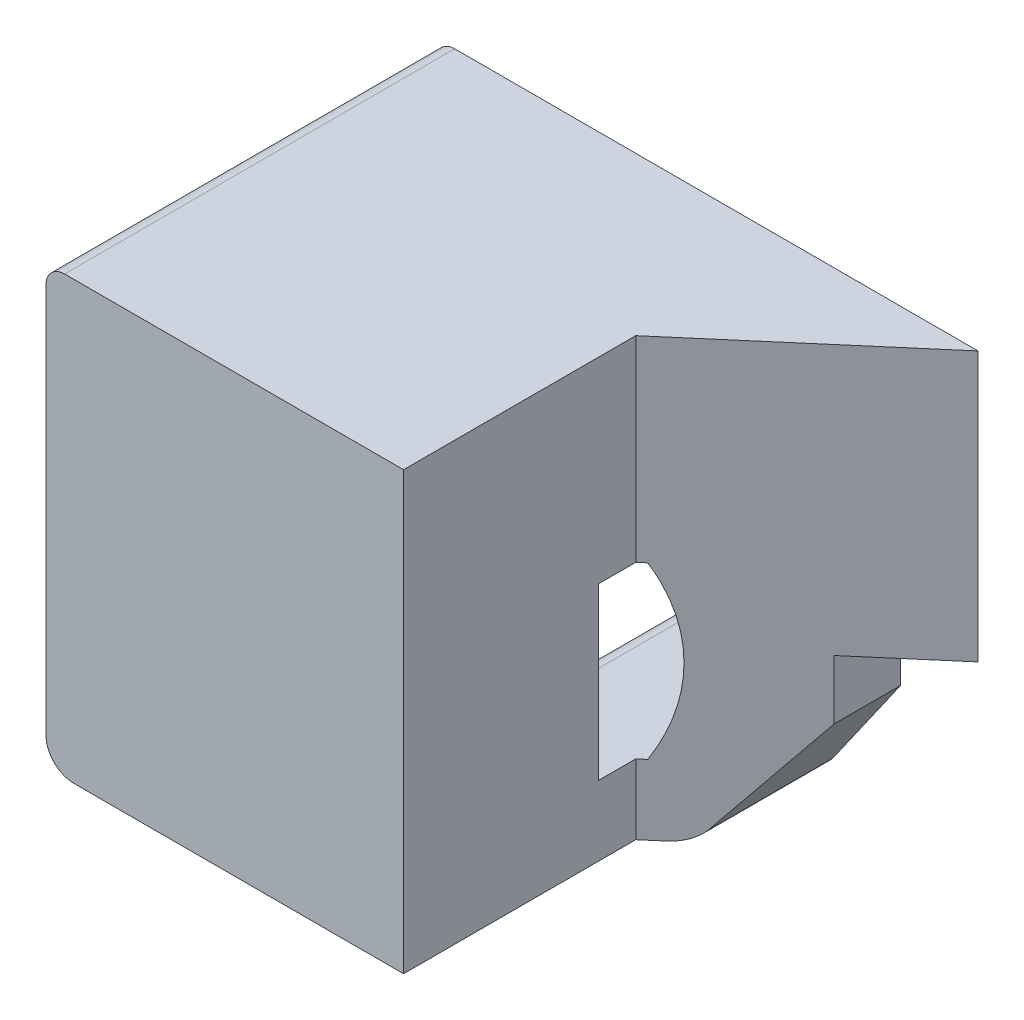
ISO-10303-21;
HEADER;
FILE_DESCRIPTION(('STEP AP214'),'2;1');
FILE_NAME('part.step','',(''),(''),'','','');
FILE_SCHEMA(('AUTOMOTIVE_DESIGN { 1 0 10303 214 1 1 1 1 }'));
ENDSEC;
DATA;
#1=APPLICATION_CONTEXT('core data for automotive mechanical design processes');
#2=APPLICATION_PROTOCOL_DEFINITION('international standard','automotive_design',2000,#1);
#3=PRODUCT_CONTEXT('',#1,'mechanical');
#4=PRODUCT('Part','Part','',(#3));
#5=PRODUCT_RELATED_PRODUCT_CATEGORY('part','',(#4));
#6=PRODUCT_DEFINITION_FORMATION('','',#4);
#7=PRODUCT_DEFINITION_CONTEXT('part definition',#1,'design');
#8=PRODUCT_DEFINITION('design','',#6,#7);
#9=PRODUCT_DEFINITION_SHAPE('','',#8);
#10=(LENGTH_UNIT() NAMED_UNIT(*) SI_UNIT(.MILLI.,.METRE.));
#11=(NAMED_UNIT(*) PLANE_ANGLE_UNIT() SI_UNIT($,.RADIAN.));
#12=(NAMED_UNIT(*) SI_UNIT($,.STERADIAN.) SOLID_ANGLE_UNIT());
#13=UNCERTAINTY_MEASURE_WITH_UNIT(LENGTH_MEASURE(1.E-05),#10,'distance_accuracy_value','');
#14=(GEOMETRIC_REPRESENTATION_CONTEXT(3) GLOBAL_UNCERTAINTY_ASSIGNED_CONTEXT((#13)) GLOBAL_UNIT_ASSIGNED_CONTEXT((#10,
#11,#12)) REPRESENTATION_CONTEXT('',''));
#15=CARTESIAN_POINT('',(0.,0.,0.));
#16=DIRECTION('',(0.,0.,1.));
#17=DIRECTION('',(1.,0.,0.));
#18=AXIS2_PLACEMENT_3D('',#15,#16,#17);
#19=CARTESIAN_POINT('',(0.,4.572,-4.7752));
#20=DIRECTION('',(0.,-1.,0.));
#21=DIRECTION('',(1.,0.,0.));
#22=AXIS2_PLACEMENT_3D('',#19,#20,#21);
#23=PLANE('',#22);
#24=DIRECTION('',(-1.,0.,0.));
#25=VECTOR('',#24,1.);
#26=CARTESIAN_POINT('',(0.,4.572,0.));
#27=LINE('',#26,#25);
#28=CARTESIAN_POINT('',(-0.0385935282545215,4.572,0.));
#29=VERTEX_POINT('',#28);
#30=CARTESIAN_POINT('',(-2.159,4.572,0.));
#31=VERTEX_POINT('',#30);
#32=EDGE_CURVE('E279',#29,#31,#27,.T.);
#33=ORIENTED_EDGE('',*,*,#32,.F.);
#34=DIRECTION('',(-0.759495170780291,0.,0.650512940348934));
#35=VECTOR('',#34,1.);
#36=CARTESIAN_POINT('',(2.34291066177672,4.572,-2.03977504099059));
#37=LINE('',#36,#35);
#38=CARTESIAN_POINT('',(-2.159,4.572,1.81614301411942));
#39=VERTEX_POINT('',#38);
#40=EDGE_CURVE('E263',#29,#39,#37,.T.);
#41=ORIENTED_EDGE('',*,*,#40,.T.);
#42=DIRECTION('',(0.,0.,1.));
#43=VECTOR('',#42,1.);
#44=CARTESIAN_POINT('',(-2.159,4.572,-7.15771843336229));
#45=LINE('',#44,#43);
#46=EDGE_CURVE('E403',#31,#39,#45,.T.);
#47=ORIENTED_EDGE('',*,*,#46,.F.);
#48=EDGE_LOOP('',(#33,#41,#47));
#49=FACE_BOUND('',#48,.T.);
#50=ADVANCED_FACE('F46',(#49),#23,.T.);
#51=CARTESIAN_POINT('',(-5.91611741875796,6.56968746053544,-6.65706713443496));
#52=DIRECTION('',(0.,-1.,0.));
#53=DIRECTION('',(1.,0.,0.));
#54=AXIS2_PLACEMENT_3D('',#51,#52,#53);
#55=PLANE('',#54);
#56=DIRECTION('',(0.,0.,1.));
#57=VECTOR('',#56,1.);
#58=CARTESIAN_POINT('',(-4.90358173333595,6.56968746053544,-8.00496258496029));
#59=LINE('',#58,#57);
#60=CARTESIAN_POINT('',(-4.90358173333595,6.56968746053544,0.));
#61=VERTEX_POINT('',#60);
#62=CARTESIAN_POINT('',(-4.90358173333595,6.56968746053544,4.16689651732612));
#63=VERTEX_POINT('',#62);
#64=EDGE_CURVE('E392',#61,#63,#59,.T.);
#65=ORIENTED_EDGE('',*,*,#64,.T.);
#66=DIRECTION('',(-0.759495170780291,0.,0.650512940348934));
#67=VECTOR('',#66,1.);
#68=CARTESIAN_POINT('',(-0.13994261088162,6.56968746053544,0.0868062000627173));
#69=LINE('',#68,#67);
#70=CARTESIAN_POINT('',(-5.08,6.56968746053544,4.318));
#71=VERTEX_POINT('',#70);
#72=EDGE_CURVE('E272',#63,#71,#69,.T.);
#73=ORIENTED_EDGE('',*,*,#72,.T.);
#74=DIRECTION('',(0.,0.,1.));
#75=VECTOR('',#74,1.);
#76=CARTESIAN_POINT('',(-5.08,6.56968746053544,-6.65706713443496));
#77=LINE('',#76,#75);
#78=CARTESIAN_POINT('',(-5.08,6.56968746053544,5.334));
#79=VERTEX_POINT('',#78);
#80=EDGE_CURVE('E538',#71,#79,#77,.T.);
#81=ORIENTED_EDGE('',*,*,#80,.T.);
#82=DIRECTION('',(1.,0.,0.));
#83=VECTOR('',#82,1.);
#84=CARTESIAN_POINT('',(-7.73402227625151,6.56968746053544,5.334));
#85=LINE('',#84,#83);
#86=CARTESIAN_POINT('',(-7.73402227625151,6.56968746053544,5.334));
#87=VERTEX_POINT('',#86);
#88=EDGE_CURVE('E468',#87,#79,#85,.T.);
#89=ORIENTED_EDGE('',*,*,#88,.F.);
#90=DIRECTION('',(0.,0.,1.));
#91=VECTOR('',#90,1.);
#92=CARTESIAN_POINT('',(-7.73402227625151,6.56968746053544,-6.65706713443496));
#93=LINE('',#92,#91);
#94=CARTESIAN_POINT('',(-7.73402227625151,6.56968746053544,0.));
#95=VERTEX_POINT('',#94);
#96=EDGE_CURVE('E361',#87,#95,#93,.F.);
#97=ORIENTED_EDGE('',*,*,#96,.T.);
#98=DIRECTION('',(-1.,0.,0.));
#99=VECTOR('',#98,1.);
#100=CARTESIAN_POINT('',(-5.91611741875796,6.56968746053544,0.));
#101=LINE('',#100,#99);
#102=EDGE_CURVE('E298',#61,#95,#101,.T.);
#103=ORIENTED_EDGE('',*,*,#102,.F.);
#104=EDGE_LOOP('',(#65,#73,#81,#89,#97,#103));
#105=FACE_BOUND('',#104,.T.);
#106=ADVANCED_FACE('F536',(#105),#55,.T.);
#107=CARTESIAN_POINT('',(-5.91611741875796,1.91391253946457,-6.59097728769885));
#108=DIRECTION('',(0.,1.,0.));
#109=DIRECTION('',(-1.,0.,0.));
#110=AXIS2_PLACEMENT_3D('',#107,#108,#109);
#111=PLANE('',#110);
#112=DIRECTION('',(0.,0.,-1.));
#113=VECTOR('',#112,1.);
#114=CARTESIAN_POINT('',(-5.08,1.91391253946457,-6.59097728769885));
#115=LINE('',#114,#113);
#116=CARTESIAN_POINT('',(-5.08,1.91391253946457,5.334));
#117=VERTEX_POINT('',#116);
#118=CARTESIAN_POINT('',(-5.08,1.91391253946457,4.318));
#119=VERTEX_POINT('',#118);
#120=EDGE_CURVE('E70',#117,#119,#115,.T.);
#121=ORIENTED_EDGE('',*,*,#120,.T.);
#122=DIRECTION('',(0.759495170780291,0.,-0.650512940348934));
#123=VECTOR('',#122,1.);
#124=CARTESIAN_POINT('',(-0.172595055513004,1.91391253946457,0.114773247891237));
#125=LINE('',#124,#123);
#126=CARTESIAN_POINT('',(-4.90358173333595,1.91391253946457,4.16689651732612));
#127=VERTEX_POINT('',#126);
#128=EDGE_CURVE('E235',#119,#127,#125,.T.);
#129=ORIENTED_EDGE('',*,*,#128,.T.);
#130=DIRECTION('',(0.,0.,1.));
#131=VECTOR('',#130,1.);
#132=CARTESIAN_POINT('',(-4.90358173333595,1.91391253946457,-8.00496258496029));
#133=LINE('',#132,#131);
#134=CARTESIAN_POINT('',(-4.90358173333595,1.91391253946457,0.));
#135=VERTEX_POINT('',#134);
#136=EDGE_CURVE('E393',#135,#127,#133,.T.);
#137=ORIENTED_EDGE('',*,*,#136,.F.);
#138=DIRECTION('',(1.,0.,0.));
#139=VECTOR('',#138,1.);
#140=CARTESIAN_POINT('',(-5.91611741875796,1.91391253946457,0.));
#141=LINE('',#140,#139);
#142=CARTESIAN_POINT('',(-7.73402227625151,1.91391253946457,0.));
#143=VERTEX_POINT('',#142);
#144=EDGE_CURVE('E291',#143,#135,#141,.T.);
#145=ORIENTED_EDGE('',*,*,#144,.F.);
#146=DIRECTION('',(0.,0.,1.));
#147=VECTOR('',#146,1.);
#148=CARTESIAN_POINT('',(-7.73402227625151,1.91391253946457,-6.59097728769885));
#149=LINE('',#148,#147);
#150=CARTESIAN_POINT('',(-7.73402227625151,1.91391253946457,5.334));
#151=VERTEX_POINT('',#150);
#152=EDGE_CURVE('E368',#143,#151,#149,.T.);
#153=ORIENTED_EDGE('',*,*,#152,.T.);
#154=DIRECTION('',(-1.,0.,0.));
#155=VECTOR('',#154,1.);
#156=CARTESIAN_POINT('',(-4.90358173333595,1.91391253946457,5.334));
#157=LINE('',#156,#155);
#158=EDGE_CURVE('E465',#117,#151,#157,.T.);
#159=ORIENTED_EDGE('',*,*,#158,.F.);
#160=EDGE_LOOP('',(#121,#129,#137,#145,#153,#159));
#161=FACE_BOUND('',#160,.T.);
#162=ADVANCED_FACE('F545',(#161),#111,.T.);
#163=CARTESIAN_POINT('',(-9.7028,4.2418,-8.00496258496029));
#164=DIRECTION('',(0.,0.,1.));
#165=DIRECTION('',(1.,0.,0.));
#166=AXIS2_PLACEMENT_3D('',#163,#164,#165);
#167=CYLINDRICAL_SURFACE('',#166,5.334);
#168=CARTESIAN_POINT('',(-9.7028,4.2418,8.27746062113275));
#169=DIRECTION('',(0.650512940348934,0.,0.759495170780291));
#170=DIRECTION('',(-0.759495170780291,0.,0.650512940348934));
#171=AXIS2_PLACEMENT_3D('',#168,#169,#170);
#172=ELLIPSE('',#171,7.02308613038309,5.334);
#173=EDGE_CURVE('E267',#63,#127,#172,.F.);
#174=ORIENTED_EDGE('',*,*,#173,.F.);
#175=ORIENTED_EDGE('',*,*,#64,.F.);
#176=CARTESIAN_POINT('',(-9.7028,4.2418,0.));
#177=DIRECTION('',(0.,0.,1.));
#178=DIRECTION('',(1.,0.,0.));
#179=AXIS2_PLACEMENT_3D('',#176,#177,#178);
#180=CIRCLE('',#179,5.334);
#181=EDGE_CURVE('E294',#61,#135,#180,.F.);
#182=ORIENTED_EDGE('',*,*,#181,.T.);
#183=ORIENTED_EDGE('',*,*,#136,.T.);
#184=EDGE_LOOP('',(#174,#175,#182,#183));
#185=FACE_BOUND('',#184,.T.);
#186=ADVANCED_FACE('F597',(#185),#167,.F.);
#187=CARTESIAN_POINT('',(-2.159,2.95035121886252,-7.15771843336229));
#188=DIRECTION('',(1.,0.,0.));
#189=DIRECTION('',(0.,0.,-1.));
#190=AXIS2_PLACEMENT_3D('',#187,#188,#189);
#191=PLANE('',#190);
#192=ORIENTED_EDGE('',*,*,#46,.T.);
#193=DIRECTION('',(0.,-1.,0.));
#194=VECTOR('',#193,1.);
#195=CARTESIAN_POINT('',(-2.159,2.95035121886252,1.81614301411942));
#196=LINE('',#195,#194);
#197=CARTESIAN_POINT('',(-2.159,2.95035121886252,1.81614301411942));
#198=VERTEX_POINT('',#197);
#199=EDGE_CURVE('E259',#39,#198,#196,.T.);
#200=ORIENTED_EDGE('',*,*,#199,.T.);
#201=DIRECTION('',(0.,0.,-1.));
#202=VECTOR('',#201,1.);
#203=CARTESIAN_POINT('',(-2.159,2.95035121886252,5.334));
#204=LINE('',#203,#202);
#205=CARTESIAN_POINT('',(-2.159,2.95035121886252,0.));
#206=VERTEX_POINT('',#205);
#207=EDGE_CURVE('E423',#198,#206,#204,.T.);
#208=ORIENTED_EDGE('',*,*,#207,.T.);
#209=DIRECTION('',(0.,1.,0.));
#210=VECTOR('',#209,1.);
#211=CARTESIAN_POINT('',(-2.159,3.83602219103803,0.));
#212=LINE('',#211,#210);
#213=EDGE_CURVE('E414',#206,#31,#212,.T.);
#214=ORIENTED_EDGE('',*,*,#213,.T.);
#215=EDGE_LOOP('',(#192,#200,#208,#214));
#216=FACE_BOUND('',#215,.T.);
#217=ADVANCED_FACE('F576',(#216),#191,.T.);
#218=CARTESIAN_POINT('',(-4.6215302563342,0.762,0.));
#219=DIRECTION('',(0.,0.,1.));
#220=DIRECTION('',(1.,0.,0.));
#221=AXIS2_PLACEMENT_3D('',#218,#219,#220);
#222=PLANE('',#221);
#223=DIRECTION('',(0.,1.,0.));
#224=VECTOR('',#223,1.);
#225=CARTESIAN_POINT('',(-0.0385935282545198,0.,0.));
#226=LINE('',#225,#224);
#227=CARTESIAN_POINT('',(-0.0385935282545242,11.938,0.));
#228=VERTEX_POINT('',#227);
#229=EDGE_CURVE('E248',#29,#228,#226,.T.);
#230=ORIENTED_EDGE('',*,*,#229,.F.);
#231=ORIENTED_EDGE('',*,*,#32,.T.);
#232=ORIENTED_EDGE('',*,*,#213,.F.);
#233=DIRECTION('',(0.573576436351051,0.819152044288989,0.));
#234=VECTOR('',#233,1.);
#235=CARTESIAN_POINT('',(-3.99733639858599,0.324934755500499,0.));
#236=LINE('',#235,#234);
#237=CARTESIAN_POINT('',(-3.99733639858599,0.324934755500499,0.));
#238=VERTEX_POINT('',#237);
#239=EDGE_CURVE('E441',#238,#206,#236,.T.);
#240=ORIENTED_EDGE('',*,*,#239,.F.);
#241=CARTESIAN_POINT('',(-4.6215302563342,0.762,0.));
#242=DIRECTION('',(0.,0.,1.));
#243=DIRECTION('',(1.,0.,0.));
#244=AXIS2_PLACEMENT_3D('',#241,#242,#243);
#245=CIRCLE('',#244,0.762000000000001);
#246=CARTESIAN_POINT('',(-4.6215302563342,0.,0.));
#247=VERTEX_POINT('',#246);
#248=EDGE_CURVE('E445',#247,#238,#245,.T.);
#249=ORIENTED_EDGE('',*,*,#248,.F.);
#250=DIRECTION('',(1.,0.,0.));
#251=VECTOR('',#250,1.);
#252=CARTESIAN_POINT('',(-8.83711741875796,0.,0.));
#253=LINE('',#252,#251);
#254=CARTESIAN_POINT('',(-8.83711741875796,0.,0.));
#255=VERTEX_POINT('',#254);
#256=EDGE_CURVE('E449',#255,#247,#253,.T.);
#257=ORIENTED_EDGE('',*,*,#256,.F.);
#258=DIRECTION('',(0.,-1.,0.));
#259=VECTOR('',#258,1.);
#260=CARTESIAN_POINT('',(-8.83711741875796,0.508,0.));
#261=LINE('',#260,#259);
#262=CARTESIAN_POINT('',(-8.83711741875796,0.756473916676449,0.));
#263=VERTEX_POINT('',#262);
#264=EDGE_CURVE('E351',#263,#255,#261,.T.);
#265=ORIENTED_EDGE('',*,*,#264,.F.);
#266=CARTESIAN_POINT('',(-8.32911741875796,0.756473916676449,0.));
#267=DIRECTION('',(0.,0.,1.));
#268=DIRECTION('',(1.,0.,0.));
#269=AXIS2_PLACEMENT_3D('',#266,#267,#268);
#270=CIRCLE('',#269,0.508);
#271=CARTESIAN_POINT('',(-8.66983985997332,1.1332659256844,0.));
#272=VERTEX_POINT('',#271);
#273=EDGE_CURVE('E282',#263,#272,#270,.F.);
#274=ORIENTED_EDGE('',*,*,#273,.T.);
#275=CARTESIAN_POINT('',(-11.4808,4.2418,0.));
#276=DIRECTION('',(0.,0.,1.));
#277=DIRECTION('',(1.,0.,0.));
#278=AXIS2_PLACEMENT_3D('',#275,#276,#277);
#279=CIRCLE('',#278,4.191);
#280=CARTESIAN_POINT('',(-8.13907932746757,1.71249496763056,0.));
#281=VERTEX_POINT('',#280);
#282=EDGE_CURVE('E285',#272,#281,#279,.T.);
#283=ORIENTED_EDGE('',*,*,#282,.T.);
#284=CARTESIAN_POINT('',(-7.73402227625151,1.40591253946457,0.));
#285=DIRECTION('',(0.,0.,1.));
#286=DIRECTION('',(1.,0.,0.));
#287=AXIS2_PLACEMENT_3D('',#284,#285,#286);
#288=CIRCLE('',#287,0.508);
#289=EDGE_CURVE('E288',#281,#143,#288,.F.);
#290=ORIENTED_EDGE('',*,*,#289,.T.);
#291=ORIENTED_EDGE('',*,*,#144,.T.);
#292=ORIENTED_EDGE('',*,*,#181,.F.);
#293=ORIENTED_EDGE('',*,*,#102,.T.);
#294=CARTESIAN_POINT('',(-7.73402227625151,7.07768746053544,0.));
#295=DIRECTION('',(0.,0.,1.));
#296=DIRECTION('',(1.,0.,0.));
#297=AXIS2_PLACEMENT_3D('',#294,#295,#296);
#298=CIRCLE('',#297,0.508);
#299=CARTESIAN_POINT('',(-8.13907932746756,6.77110503236944,0.));
#300=VERTEX_POINT('',#299);
#301=EDGE_CURVE('E301',#95,#300,#298,.F.);
#302=ORIENTED_EDGE('',*,*,#301,.T.);
#303=CARTESIAN_POINT('',(-11.4808,4.2418,0.));
#304=DIRECTION('',(0.,0.,1.));
#305=DIRECTION('',(1.,0.,0.));
#306=AXIS2_PLACEMENT_3D('',#303,#304,#305);
#307=CIRCLE('',#306,4.191);
#308=CARTESIAN_POINT('',(-8.83711741875796,7.49378760908424,0.));
#309=VERTEX_POINT('',#308);
#310=EDGE_CURVE('E304',#300,#309,#307,.T.);
#311=ORIENTED_EDGE('',*,*,#310,.T.);
#312=DIRECTION('',(-0.775945504434321,0.630799947802921,0.));
#313=VECTOR('',#312,1.);
#314=CARTESIAN_POINT('',(-8.83711741875796,7.49378760908424,0.));
#315=LINE('',#314,#313);
#316=CARTESIAN_POINT('',(-9.83014940932229,8.30106663091615,0.));
#317=VERTEX_POINT('',#316);
#318=EDGE_CURVE('E307',#309,#317,#315,.T.);
#319=ORIENTED_EDGE('',*,*,#318,.T.);
#320=CARTESIAN_POINT('',(-11.9888,5.64571571131814,0.));
#321=DIRECTION('',(0.,0.,1.));
#322=DIRECTION('',(1.,0.,0.));
#323=AXIS2_PLACEMENT_3D('',#320,#321,#322);
#324=CIRCLE('',#323,3.42208428868186);
#325=CARTESIAN_POINT('',(-11.9888,9.0678,0.));
#326=VERTEX_POINT('',#325);
#327=EDGE_CURVE('E310',#317,#326,#324,.T.);
#328=ORIENTED_EDGE('',*,*,#327,.T.);
#329=CARTESIAN_POINT('',(-11.9888,4.2418,0.));
#330=DIRECTION('',(0.,0.,1.));
#331=DIRECTION('',(1.,0.,0.));
#332=AXIS2_PLACEMENT_3D('',#329,#330,#331);
#333=CIRCLE('',#332,4.826);
#334=CARTESIAN_POINT('',(-14.859,8.12152008784139,0.));
#335=VERTEX_POINT('',#334);
#336=EDGE_CURVE('E313',#335,#326,#333,.F.);
#337=ORIENTED_EDGE('',*,*,#336,.F.);
#338=DIRECTION('',(0.,1.,0.));
#339=VECTOR('',#338,1.);
#340=CARTESIAN_POINT('',(-14.859,12.5021579791919,0.));
#341=LINE('',#340,#339);
#342=CARTESIAN_POINT('',(-14.859,11.43,0.));
#343=VERTEX_POINT('',#342);
#344=EDGE_CURVE('E276',#335,#343,#341,.T.);
#345=ORIENTED_EDGE('',*,*,#344,.T.);
#346=CARTESIAN_POINT('',(-14.351,11.43,0.));
#347=DIRECTION('',(0.,0.,1.));
#348=DIRECTION('',(1.,0.,0.));
#349=AXIS2_PLACEMENT_3D('',#346,#347,#348);
#350=CIRCLE('',#349,0.508);
#351=CARTESIAN_POINT('',(-14.351,11.938,0.));
#352=VERTEX_POINT('',#351);
#353=EDGE_CURVE('E413',#352,#343,#350,.T.);
#354=ORIENTED_EDGE('',*,*,#353,.F.);
#355=DIRECTION('',(-1.,0.,0.));
#356=VECTOR('',#355,1.);
#357=CARTESIAN_POINT('',(-0.0385935282545242,11.938,0.));
#358=LINE('',#357,#356);
#359=EDGE_CURVE('E410',#228,#352,#358,.T.);
#360=ORIENTED_EDGE('',*,*,#359,.F.);
#361=EDGE_LOOP('',(#230,#231,#232,#240,#249,#257,#265,#274,#283,#290,#291,#292,#293,#302,#311,
#319,#328,#337,#345,#354,#360));
#362=FACE_BOUND('',#361,.T.);
#363=ADVANCED_FACE('F564',(#362),#222,.F.);
#364=CARTESIAN_POINT('',(-8.83711741875796,0.,5.334));
#365=DIRECTION('',(0.,1.,0.));
#366=DIRECTION('',(-1.,0.,0.));
#367=AXIS2_PLACEMENT_3D('',#364,#365,#366);
#368=PLANE('',#367);
#369=DIRECTION('',(0.759495170780291,0.,-0.650512940348934));
#370=VECTOR('',#369,1.);
#371=CARTESIAN_POINT('',(-0.016331510872997,0.,-0.0190675740177184));
#372=LINE('',#371,#370);
#373=CARTESIAN_POINT('',(-5.08,0.,4.318));
#374=VERTEX_POINT('',#373);
#375=CARTESIAN_POINT('',(-4.6215302563342,0.,3.92531744915948));
#376=VERTEX_POINT('',#375);
#377=EDGE_CURVE('E229',#374,#376,#372,.T.);
#378=ORIENTED_EDGE('',*,*,#377,.F.);
#379=DIRECTION('',(0.,0.,-1.));
#380=VECTOR('',#379,1.);
#381=CARTESIAN_POINT('',(-5.08,0.,0.));
#382=LINE('',#381,#380);
#383=CARTESIAN_POINT('',(-5.08,0.,10.668));
#384=VERTEX_POINT('',#383);
#385=EDGE_CURVE('E219',#384,#374,#382,.T.);
#386=ORIENTED_EDGE('',*,*,#385,.F.);
#387=DIRECTION('',(1.,0.,0.));
#388=VECTOR('',#387,1.);
#389=CARTESIAN_POINT('',(0.,0.,10.668));
#390=LINE('',#389,#388);
#391=CARTESIAN_POINT('',(-14.097,0.,10.668));
#392=VERTEX_POINT('',#391);
#393=EDGE_CURVE('E322',#392,#384,#390,.T.);
#394=ORIENTED_EDGE('',*,*,#393,.F.);
#395=DIRECTION('',(0.,0.,-1.));
#396=VECTOR('',#395,1.);
#397=CARTESIAN_POINT('',(-14.097,0.,10.668));
#398=LINE('',#397,#396);
#399=CARTESIAN_POINT('',(-14.097,0.,5.334));
#400=VERTEX_POINT('',#399);
#401=EDGE_CURVE('E347',#392,#400,#398,.T.);
#402=ORIENTED_EDGE('',*,*,#401,.T.);
#403=DIRECTION('',(1.,0.,0.));
#404=VECTOR('',#403,1.);
#405=CARTESIAN_POINT('',(0.,0.,5.334));
#406=LINE('',#405,#404);
#407=CARTESIAN_POINT('',(-8.83711741875796,0.,5.334));
#408=VERTEX_POINT('',#407);
#409=EDGE_CURVE('E338',#400,#408,#406,.T.);
#410=ORIENTED_EDGE('',*,*,#409,.T.);
#411=DIRECTION('',(0.,0.,-1.));
#412=VECTOR('',#411,1.);
#413=CARTESIAN_POINT('',(-8.83711741875796,0.,5.334));
#414=LINE('',#413,#412);
#415=EDGE_CURVE('E407',#408,#255,#414,.T.);
#416=ORIENTED_EDGE('',*,*,#415,.T.);
#417=ORIENTED_EDGE('',*,*,#256,.T.);
#418=DIRECTION('',(0.,0.,-1.));
#419=VECTOR('',#418,1.);
#420=CARTESIAN_POINT('',(-4.6215302563342,0.,5.334));
#421=LINE('',#420,#419);
#422=EDGE_CURVE('E241',#376,#247,#421,.T.);
#423=ORIENTED_EDGE('',*,*,#422,.F.);
#424=EDGE_LOOP('',(#378,#386,#394,#402,#410,#416,#417,#423));
#425=FACE_BOUND('',#424,.T.);
#426=ADVANCED_FACE('F239',(#425),#368,.F.);
#427=CARTESIAN_POINT('',(-4.6215302563342,0.762,5.334));
#428=DIRECTION('',(0.,0.,-1.));
#429=DIRECTION('',(-1.,0.,0.));
#430=AXIS2_PLACEMENT_3D('',#427,#428,#429);
#431=CYLINDRICAL_SURFACE('',#430,0.762000000000001);
#432=CARTESIAN_POINT('',(-4.6215302563342,0.762,3.92531744915948));
#433=DIRECTION('',(0.650512940348934,0.,0.759495170780291));
#434=DIRECTION('',(0.759495170780291,0.,-0.650512940348934));
#435=AXIS2_PLACEMENT_3D('',#432,#433,#434);
#436=ELLIPSE('',#435,1.00329801862616,0.762000000000001);
#437=CARTESIAN_POINT('',(-3.99733639858599,0.324934755500498,3.39069103233267));
#438=VERTEX_POINT('',#437);
#439=EDGE_CURVE('E256',#376,#438,#436,.T.);
#440=ORIENTED_EDGE('',*,*,#439,.F.);
#441=ORIENTED_EDGE('',*,*,#422,.T.);
#442=ORIENTED_EDGE('',*,*,#248,.T.);
#443=DIRECTION('',(0.,0.,-1.));
#444=VECTOR('',#443,1.);
#445=CARTESIAN_POINT('',(-3.99733639858599,0.324934755500499,5.334));
#446=LINE('',#445,#444);
#447=EDGE_CURVE('E420',#438,#238,#446,.T.);
#448=ORIENTED_EDGE('',*,*,#447,.F.);
#449=EDGE_LOOP('',(#440,#441,#442,#448));
#450=FACE_BOUND('',#449,.T.);
#451=ADVANCED_FACE('F570',(#450),#431,.T.);
#452=CARTESIAN_POINT('',(-3.99733639858599,0.324934755500499,5.334));
#453=DIRECTION('',(-0.819152044288989,0.573576436351051,0.));
#454=DIRECTION('',(-0.573576436351051,-0.819152044288989,0.));
#455=AXIS2_PLACEMENT_3D('',#452,#453,#454);
#456=PLANE('',#455);
#457=DIRECTION('',(0.514807012984307,0.735220609450391,-0.440935817122596));
#458=VECTOR('',#457,1.);
#459=CARTESIAN_POINT('',(-4.43846141463182,-0.305057056889431,3.76851770232272));
#460=LINE('',#459,#458);
#461=EDGE_CURVE('E253',#438,#198,#460,.T.);
#462=ORIENTED_EDGE('',*,*,#461,.F.);
#463=ORIENTED_EDGE('',*,*,#447,.T.);
#464=ORIENTED_EDGE('',*,*,#239,.T.);
#465=ORIENTED_EDGE('',*,*,#207,.F.);
#466=EDGE_LOOP('',(#462,#463,#464,#465));
#467=FACE_BOUND('',#466,.T.);
#468=ADVANCED_FACE('F574',(#467),#456,.F.);
#469=CARTESIAN_POINT('',(-0.0385935282545242,11.938,5.334));
#470=DIRECTION('',(0.,-1.,0.));
#471=DIRECTION('',(1.,0.,0.));
#472=AXIS2_PLACEMENT_3D('',#469,#470,#471);
#473=PLANE('',#472);
#474=DIRECTION('',(-0.759495170780291,0.,0.650512940348934));
#475=VECTOR('',#474,1.);
#476=CARTESIAN_POINT('',(-2.67391723174622,11.938,2.25717323438459));
#477=LINE('',#476,#475);
#478=CARTESIAN_POINT('',(-5.08,11.938,4.318));
#479=VERTEX_POINT('',#478);
#480=EDGE_CURVE('E11',#228,#479,#477,.T.);
#481=ORIENTED_EDGE('',*,*,#480,.F.);
#482=ORIENTED_EDGE('',*,*,#359,.T.);
#483=DIRECTION('',(0.,0.,-1.));
#484=VECTOR('',#483,1.);
#485=CARTESIAN_POINT('',(-14.351,11.938,5.334));
#486=LINE('',#485,#484);
#487=CARTESIAN_POINT('',(-14.351,11.938,10.668));
#488=VERTEX_POINT('',#487);
#489=EDGE_CURVE('E426',#488,#352,#486,.T.);
#490=ORIENTED_EDGE('',*,*,#489,.F.);
#491=DIRECTION('',(-1.,0.,0.));
#492=VECTOR('',#491,1.);
#493=CARTESIAN_POINT('',(0.,11.938,10.668));
#494=LINE('',#493,#492);
#495=CARTESIAN_POINT('',(-5.08,11.938,10.668));
#496=VERTEX_POINT('',#495);
#497=EDGE_CURVE('E326',#496,#488,#494,.T.);
#498=ORIENTED_EDGE('',*,*,#497,.F.);
#499=DIRECTION('',(0.,0.,1.));
#500=VECTOR('',#499,1.);
#501=CARTESIAN_POINT('',(-5.08,11.938,5.334));
#502=LINE('',#501,#500);
#503=EDGE_CURVE('E63',#479,#496,#502,.T.);
#504=ORIENTED_EDGE('',*,*,#503,.F.);
#505=EDGE_LOOP('',(#481,#482,#490,#498,#504));
#506=FACE_BOUND('',#505,.T.);
#507=ADVANCED_FACE('F583',(#506),#473,.F.);
#508=CARTESIAN_POINT('',(0.,0.,10.668));
#509=DIRECTION('',(0.,0.,1.));
#510=DIRECTION('',(1.,0.,0.));
#511=AXIS2_PLACEMENT_3D('',#508,#509,#510);
#512=PLANE('',#511);
#513=ORIENTED_EDGE('',*,*,#393,.T.);
#514=DIRECTION('',(0.,1.,0.));
#515=VECTOR('',#514,1.);
#516=CARTESIAN_POINT('',(-5.08,0.,10.668));
#517=LINE('',#516,#515);
#518=EDGE_CURVE('E223',#384,#496,#517,.T.);
#519=ORIENTED_EDGE('',*,*,#518,.T.);
#520=ORIENTED_EDGE('',*,*,#497,.T.);
#521=CARTESIAN_POINT('',(-14.351,11.43,10.668));
#522=DIRECTION('',(0.,0.,1.));
#523=DIRECTION('',(1.,0.,0.));
#524=AXIS2_PLACEMENT_3D('',#521,#522,#523);
#525=CIRCLE('',#524,0.508);
#526=CARTESIAN_POINT('',(-14.859,11.43,10.668));
#527=VERTEX_POINT('',#526);
#528=EDGE_CURVE('E327',#488,#527,#525,.T.);
#529=ORIENTED_EDGE('',*,*,#528,.T.);
#530=DIRECTION('',(0.,-1.,0.));
#531=VECTOR('',#530,1.);
#532=CARTESIAN_POINT('',(-14.8590000000001,0.,10.668));
#533=LINE('',#532,#531);
#534=CARTESIAN_POINT('',(-14.859,0.762000000000001,10.668));
#535=VERTEX_POINT('',#534);
#536=EDGE_CURVE('E331',#527,#535,#533,.T.);
#537=ORIENTED_EDGE('',*,*,#536,.T.);
#538=CARTESIAN_POINT('',(-14.097,0.762000000000001,10.668));
#539=DIRECTION('',(0.,0.,1.));
#540=DIRECTION('',(1.,0.,0.));
#541=AXIS2_PLACEMENT_3D('',#538,#539,#540);
#542=CIRCLE('',#541,0.762000000000002);
#543=EDGE_CURVE('E318',#535,#392,#542,.T.);
#544=ORIENTED_EDGE('',*,*,#543,.T.);
#545=EDGE_LOOP('',(#513,#519,#520,#529,#537,#544));
#546=FACE_BOUND('',#545,.T.);
#547=ADVANCED_FACE('F591',(#546),#512,.T.);
#548=CARTESIAN_POINT('',(0.,0.,5.334));
#549=DIRECTION('',(0.,0.,1.));
#550=DIRECTION('',(1.,0.,0.));
#551=AXIS2_PLACEMENT_3D('',#548,#549,#550);
#552=PLANE('',#551);
#553=DIRECTION('',(0.,1.,0.));
#554=VECTOR('',#553,1.);
#555=CARTESIAN_POINT('',(-5.08,0.,5.334));
#556=LINE('',#555,#554);
#557=EDGE_CURVE('E56',#117,#79,#556,.T.);
#558=ORIENTED_EDGE('',*,*,#557,.F.);
#559=ORIENTED_EDGE('',*,*,#158,.T.);
#560=CARTESIAN_POINT('',(-7.73402227625151,1.40591253946457,5.334));
#561=DIRECTION('',(0.,0.,1.));
#562=DIRECTION('',(1.,0.,0.));
#563=AXIS2_PLACEMENT_3D('',#560,#561,#562);
#564=CIRCLE('',#563,0.508);
#565=CARTESIAN_POINT('',(-8.13907932746757,1.71249496763056,5.334));
#566=VERTEX_POINT('',#565);
#567=EDGE_CURVE('E461',#151,#566,#564,.T.);
#568=ORIENTED_EDGE('',*,*,#567,.T.);
#569=CARTESIAN_POINT('',(-11.4808,4.2418,5.334));
#570=DIRECTION('',(0.,0.,-1.));
#571=DIRECTION('',(1.,0.,0.));
#572=AXIS2_PLACEMENT_3D('',#569,#570,#571);
#573=CIRCLE('',#572,4.191);
#574=CARTESIAN_POINT('',(-8.66983985997332,1.1332659256844,5.334));
#575=VERTEX_POINT('',#574);
#576=EDGE_CURVE('E457',#566,#575,#573,.T.);
#577=ORIENTED_EDGE('',*,*,#576,.T.);
#578=CARTESIAN_POINT('',(-8.32911741875796,0.756473916676449,5.334));
#579=DIRECTION('',(0.,0.,1.));
#580=DIRECTION('',(1.,0.,0.));
#581=AXIS2_PLACEMENT_3D('',#578,#579,#580);
#582=CIRCLE('',#581,0.508);
#583=CARTESIAN_POINT('',(-8.83711741875796,0.756473916676449,5.334));
#584=VERTEX_POINT('',#583);
#585=EDGE_CURVE('E434',#575,#584,#582,.T.);
#586=ORIENTED_EDGE('',*,*,#585,.T.);
#587=DIRECTION('',(0.,-1.,0.));
#588=VECTOR('',#587,1.);
#589=CARTESIAN_POINT('',(-8.83711741875796,0.756473916676449,5.334));
#590=LINE('',#589,#588);
#591=EDGE_CURVE('E354',#584,#408,#590,.T.);
#592=ORIENTED_EDGE('',*,*,#591,.T.);
#593=ORIENTED_EDGE('',*,*,#409,.F.);
#594=CARTESIAN_POINT('',(-14.097,0.762000000000001,5.334));
#595=DIRECTION('',(0.,0.,1.));
#596=DIRECTION('',(1.,0.,0.));
#597=AXIS2_PLACEMENT_3D('',#594,#595,#596);
#598=CIRCLE('',#597,0.762000000000002);
#599=CARTESIAN_POINT('',(-14.859,0.762000000000001,5.334));
#600=VERTEX_POINT('',#599);
#601=EDGE_CURVE('E317',#600,#400,#598,.T.);
#602=ORIENTED_EDGE('',*,*,#601,.F.);
#603=DIRECTION('',(0.,-1.,0.));
#604=VECTOR('',#603,1.);
#605=CARTESIAN_POINT('',(-14.8590000000001,0.,5.334));
#606=LINE('',#605,#604);
#607=CARTESIAN_POINT('',(-14.859,8.12152008784138,5.334));
#608=VERTEX_POINT('',#607);
#609=EDGE_CURVE('E323',#608,#600,#606,.T.);
#610=ORIENTED_EDGE('',*,*,#609,.F.);
#611=CARTESIAN_POINT('',(-11.9888,4.2418,5.334));
#612=DIRECTION('',(0.,0.,-1.));
#613=DIRECTION('',(1.,0.,0.));
#614=AXIS2_PLACEMENT_3D('',#611,#612,#613);
#615=CIRCLE('',#614,4.826);
#616=CARTESIAN_POINT('',(-11.9888,9.0678,5.334));
#617=VERTEX_POINT('',#616);
#618=EDGE_CURVE('E487',#608,#617,#615,.T.);
#619=ORIENTED_EDGE('',*,*,#618,.T.);
#620=CARTESIAN_POINT('',(-11.9888,5.64571571131814,5.334));
#621=DIRECTION('',(0.,0.,-1.));
#622=DIRECTION('',(1.,0.,0.));
#623=AXIS2_PLACEMENT_3D('',#620,#621,#622);
#624=CIRCLE('',#623,3.42208428868186);
#625=CARTESIAN_POINT('',(-9.83014940932229,8.30106663091615,5.334));
#626=VERTEX_POINT('',#625);
#627=EDGE_CURVE('E484',#617,#626,#624,.T.);
#628=ORIENTED_EDGE('',*,*,#627,.T.);
#629=DIRECTION('',(0.775945504434321,-0.630799947802921,0.));
#630=VECTOR('',#629,1.);
#631=CARTESIAN_POINT('',(-9.83014940932229,8.30106663091615,5.334));
#632=LINE('',#631,#630);
#633=CARTESIAN_POINT('',(-8.83711741875796,7.49378760908424,5.334));
#634=VERTEX_POINT('',#633);
#635=EDGE_CURVE('E480',#626,#634,#632,.T.);
#636=ORIENTED_EDGE('',*,*,#635,.T.);
#637=CARTESIAN_POINT('',(-11.4808,4.2418,5.334));
#638=DIRECTION('',(0.,0.,-1.));
#639=DIRECTION('',(1.,0.,0.));
#640=AXIS2_PLACEMENT_3D('',#637,#638,#639);
#641=CIRCLE('',#640,4.191);
#642=CARTESIAN_POINT('',(-8.13907932746756,6.77110503236944,5.334));
#643=VERTEX_POINT('',#642);
#644=EDGE_CURVE('E476',#634,#643,#641,.T.);
#645=ORIENTED_EDGE('',*,*,#644,.T.);
#646=CARTESIAN_POINT('',(-7.73402227625151,7.07768746053544,5.334));
#647=DIRECTION('',(0.,0.,1.));
#648=DIRECTION('',(1.,0.,0.));
#649=AXIS2_PLACEMENT_3D('',#646,#647,#648);
#650=CIRCLE('',#649,0.508);
#651=EDGE_CURVE('E472',#643,#87,#650,.T.);
#652=ORIENTED_EDGE('',*,*,#651,.T.);
#653=ORIENTED_EDGE('',*,*,#88,.T.);
#654=EDGE_LOOP('',(#558,#559,#568,#577,#586,#592,#593,#602,#610,#619,#628,#636,#645,#652,#653));
#655=FACE_BOUND('',#654,.T.);
#656=ADVANCED_FACE('F495',(#655),#552,.F.);
#657=CARTESIAN_POINT('',(-14.859,11.938,-4.7752));
#658=DIRECTION('',(-1.,0.,0.));
#659=DIRECTION('',(0.,-1.,0.));
#660=AXIS2_PLACEMENT_3D('',#657,#658,#659);
#661=PLANE('',#660);
#662=ORIENTED_EDGE('',*,*,#344,.F.);
#663=DIRECTION('',(0.,0.,1.));
#664=VECTOR('',#663,1.);
#665=CARTESIAN_POINT('',(-14.859,8.12152008784138,-3.0988));
#666=LINE('',#665,#664);
#667=EDGE_CURVE('E383',#335,#608,#666,.T.);
#668=ORIENTED_EDGE('',*,*,#667,.T.);
#669=ORIENTED_EDGE('',*,*,#609,.T.);
#670=DIRECTION('',(0.,0.,-1.));
#671=VECTOR('',#670,1.);
#672=CARTESIAN_POINT('',(-14.859,0.762000000000001,10.668));
#673=LINE('',#672,#671);
#674=EDGE_CURVE('E334',#535,#600,#673,.T.);
#675=ORIENTED_EDGE('',*,*,#674,.F.);
#676=ORIENTED_EDGE('',*,*,#536,.F.);
#677=DIRECTION('',(0.,0.,-1.));
#678=VECTOR('',#677,1.);
#679=CARTESIAN_POINT('',(-14.859,11.43,5.334));
#680=LINE('',#679,#678);
#681=EDGE_CURVE('E430',#527,#343,#680,.T.);
#682=ORIENTED_EDGE('',*,*,#681,.T.);
#683=EDGE_LOOP('',(#662,#668,#669,#675,#676,#682));
#684=FACE_BOUND('',#683,.T.);
#685=ADVANCED_FACE('F508',(#684),#661,.T.);
#686=CARTESIAN_POINT('',(-11.9888,4.2418,-3.0988));
#687=DIRECTION('',(0.,0.,1.));
#688=DIRECTION('',(1.,0.,0.));
#689=AXIS2_PLACEMENT_3D('',#686,#687,#688);
#690=CYLINDRICAL_SURFACE('',#689,4.826);
#691=ORIENTED_EDGE('',*,*,#667,.F.);
#692=ORIENTED_EDGE('',*,*,#336,.T.);
#693=DIRECTION('',(0.,0.,1.));
#694=VECTOR('',#693,1.);
#695=CARTESIAN_POINT('',(-11.9888,9.0678,-3.0988));
#696=LINE('',#695,#694);
#697=EDGE_CURVE('E384',#326,#617,#696,.T.);
#698=ORIENTED_EDGE('',*,*,#697,.T.);
#699=ORIENTED_EDGE('',*,*,#618,.F.);
#700=EDGE_LOOP('',(#691,#692,#698,#699));
#701=FACE_BOUND('',#700,.T.);
#702=ADVANCED_FACE('F512',(#701),#690,.F.);
#703=CARTESIAN_POINT('',(-11.4808,4.2418,-6.65706713443496));
#704=DIRECTION('',(0.,0.,1.));
#705=DIRECTION('',(1.,0.,0.));
#706=AXIS2_PLACEMENT_3D('',#703,#704,#705);
#707=CYLINDRICAL_SURFACE('',#706,4.191);
#708=ORIENTED_EDGE('',*,*,#310,.F.);
#709=DIRECTION('',(0.,0.,1.));
#710=VECTOR('',#709,1.);
#711=CARTESIAN_POINT('',(-8.13907932746756,6.77110503236944,-6.65706713443496));
#712=LINE('',#711,#710);
#713=EDGE_CURVE('E365',#300,#643,#712,.T.);
#714=ORIENTED_EDGE('',*,*,#713,.T.);
#715=ORIENTED_EDGE('',*,*,#644,.F.);
#716=DIRECTION('',(0.,0.,1.));
#717=VECTOR('',#716,1.);
#718=CARTESIAN_POINT('',(-8.83711741875796,7.49378760908424,-6.65706713443496));
#719=LINE('',#718,#717);
#720=EDGE_CURVE('E387',#309,#634,#719,.T.);
#721=ORIENTED_EDGE('',*,*,#720,.F.);
#722=EDGE_LOOP('',(#708,#714,#715,#721));
#723=FACE_BOUND('',#722,.T.);
#724=ADVANCED_FACE('F527',(#723),#707,.F.);
#725=CARTESIAN_POINT('',(-8.83711741875796,0.,-6.59097728769885));
#726=DIRECTION('',(-1.,0.,0.));
#727=DIRECTION('',(0.,0.,1.));
#728=AXIS2_PLACEMENT_3D('',#725,#726,#727);
#729=PLANE('',#728);
#730=DIRECTION('',(0.,0.,1.));
#731=VECTOR('',#730,1.);
#732=CARTESIAN_POINT('',(-8.83711741875796,0.756473916676449,-6.59097728769885));
#733=LINE('',#732,#731);
#734=EDGE_CURVE('E372',#584,#263,#733,.F.);
#735=ORIENTED_EDGE('',*,*,#734,.T.);
#736=ORIENTED_EDGE('',*,*,#264,.T.);
#737=ORIENTED_EDGE('',*,*,#415,.F.);
#738=ORIENTED_EDGE('',*,*,#591,.F.);
#739=EDGE_LOOP('',(#735,#736,#737,#738));
#740=FACE_BOUND('',#739,.T.);
#741=ADVANCED_FACE('F561',(#740),#729,.T.);
#742=CARTESIAN_POINT('',(-11.4808,4.2418,-6.59097728769885));
#743=DIRECTION('',(0.,0.,1.));
#744=DIRECTION('',(1.,0.,0.));
#745=AXIS2_PLACEMENT_3D('',#742,#743,#744);
#746=CYLINDRICAL_SURFACE('',#745,4.191);
#747=ORIENTED_EDGE('',*,*,#282,.F.);
#748=DIRECTION('',(0.,0.,1.));
#749=VECTOR('',#748,1.);
#750=CARTESIAN_POINT('',(-8.66983985997332,1.1332659256844,-6.59097728769885));
#751=LINE('',#750,#749);
#752=EDGE_CURVE('E376',#272,#575,#751,.T.);
#753=ORIENTED_EDGE('',*,*,#752,.T.);
#754=ORIENTED_EDGE('',*,*,#576,.F.);
#755=DIRECTION('',(0.,0.,1.));
#756=VECTOR('',#755,1.);
#757=CARTESIAN_POINT('',(-8.13907932746757,1.71249496763056,-6.59097728769885));
#758=LINE('',#757,#756);
#759=EDGE_CURVE('E379',#566,#281,#758,.F.);
#760=ORIENTED_EDGE('',*,*,#759,.T.);
#761=EDGE_LOOP('',(#747,#753,#754,#760));
#762=FACE_BOUND('',#761,.T.);
#763=ADVANCED_FACE('F556',(#762),#746,.F.);
#764=CARTESIAN_POINT('',(-8.83711741875796,7.49378760908424,-6.62167071855622));
#765=DIRECTION('',(-0.630799947802921,-0.775945504434321,0.));
#766=DIRECTION('',(0.775945504434321,-0.630799947802921,0.));
#767=AXIS2_PLACEMENT_3D('',#764,#765,#766);
#768=PLANE('',#767);
#769=ORIENTED_EDGE('',*,*,#318,.F.);
#770=ORIENTED_EDGE('',*,*,#720,.T.);
#771=ORIENTED_EDGE('',*,*,#635,.F.);
#772=DIRECTION('',(0.,0.,1.));
#773=VECTOR('',#772,1.);
#774=CARTESIAN_POINT('',(-9.83014940932229,8.30106663091615,-6.62167071855622));
#775=LINE('',#774,#773);
#776=EDGE_CURVE('E397',#317,#626,#775,.T.);
#777=ORIENTED_EDGE('',*,*,#776,.F.);
#778=EDGE_LOOP('',(#769,#770,#771,#777));
#779=FACE_BOUND('',#778,.T.);
#780=ADVANCED_FACE('F523',(#779),#768,.T.);
#781=CARTESIAN_POINT('',(-11.9888,5.64571571131814,-6.62167071855622));
#782=DIRECTION('',(0.,0.,1.));
#783=DIRECTION('',(1.,0.,0.));
#784=AXIS2_PLACEMENT_3D('',#781,#782,#783);
#785=CYLINDRICAL_SURFACE('',#784,3.42208428868186);
#786=ORIENTED_EDGE('',*,*,#327,.F.);
#787=ORIENTED_EDGE('',*,*,#776,.T.);
#788=ORIENTED_EDGE('',*,*,#627,.F.);
#789=ORIENTED_EDGE('',*,*,#697,.F.);
#790=EDGE_LOOP('',(#786,#787,#788,#789));
#791=FACE_BOUND('',#790,.T.);
#792=ADVANCED_FACE('F517',(#791),#785,.F.);
#793=CARTESIAN_POINT('',(-8.32911741875796,0.756473916676449,-6.59097728769885));
#794=DIRECTION('',(0.,0.,1.));
#795=DIRECTION('',(1.,0.,0.));
#796=AXIS2_PLACEMENT_3D('',#793,#794,#795);
#797=CYLINDRICAL_SURFACE('',#796,0.508);
#798=ORIENTED_EDGE('',*,*,#273,.F.);
#799=ORIENTED_EDGE('',*,*,#734,.F.);
#800=ORIENTED_EDGE('',*,*,#585,.F.);
#801=ORIENTED_EDGE('',*,*,#752,.F.);
#802=EDGE_LOOP('',(#798,#799,#800,#801));
#803=FACE_BOUND('',#802,.T.);
#804=ADVANCED_FACE('F560',(#803),#797,.T.);
#805=CARTESIAN_POINT('',(-7.73402227625151,1.40591253946457,-6.59097728769885));
#806=DIRECTION('',(0.,0.,1.));
#807=DIRECTION('',(1.,0.,0.));
#808=AXIS2_PLACEMENT_3D('',#805,#806,#807);
#809=CYLINDRICAL_SURFACE('',#808,0.508);
#810=ORIENTED_EDGE('',*,*,#289,.F.);
#811=ORIENTED_EDGE('',*,*,#759,.F.);
#812=ORIENTED_EDGE('',*,*,#567,.F.);
#813=ORIENTED_EDGE('',*,*,#152,.F.);
#814=EDGE_LOOP('',(#810,#811,#812,#813));
#815=FACE_BOUND('',#814,.T.);
#816=ADVANCED_FACE('F553',(#815),#809,.T.);
#817=CARTESIAN_POINT('',(-7.73402227625151,7.07768746053544,-6.65706713443496));
#818=DIRECTION('',(0.,0.,1.));
#819=DIRECTION('',(1.,0.,0.));
#820=AXIS2_PLACEMENT_3D('',#817,#818,#819);
#821=CYLINDRICAL_SURFACE('',#820,0.508);
#822=ORIENTED_EDGE('',*,*,#301,.F.);
#823=ORIENTED_EDGE('',*,*,#96,.F.);
#824=ORIENTED_EDGE('',*,*,#651,.F.);
#825=ORIENTED_EDGE('',*,*,#713,.F.);
#826=EDGE_LOOP('',(#822,#823,#824,#825));
#827=FACE_BOUND('',#826,.T.);
#828=ADVANCED_FACE('F48',(#827),#821,.T.);
#829=CARTESIAN_POINT('',(-14.351,11.43,5.334));
#830=DIRECTION('',(0.,0.,-1.));
#831=DIRECTION('',(-1.,0.,0.));
#832=AXIS2_PLACEMENT_3D('',#829,#830,#831);
#833=CYLINDRICAL_SURFACE('',#832,0.508);
#834=ORIENTED_EDGE('',*,*,#353,.T.);
#835=ORIENTED_EDGE('',*,*,#681,.F.);
#836=ORIENTED_EDGE('',*,*,#528,.F.);
#837=ORIENTED_EDGE('',*,*,#489,.T.);
#838=EDGE_LOOP('',(#834,#835,#836,#837));
#839=FACE_BOUND('',#838,.T.);
#840=ADVANCED_FACE('F588',(#839),#833,.T.);
#841=CARTESIAN_POINT('',(-14.097,0.762000000000001,10.668));
#842=DIRECTION('',(0.,0.,-1.));
#843=DIRECTION('',(-1.,0.,0.));
#844=AXIS2_PLACEMENT_3D('',#841,#842,#843);
#845=CYLINDRICAL_SURFACE('',#844,0.762000000000002);
#846=ORIENTED_EDGE('',*,*,#601,.T.);
#847=ORIENTED_EDGE('',*,*,#401,.F.);
#848=ORIENTED_EDGE('',*,*,#543,.F.);
#849=ORIENTED_EDGE('',*,*,#674,.T.);
#850=EDGE_LOOP('',(#846,#847,#848,#849));
#851=FACE_BOUND('',#850,.T.);
#852=ADVANCED_FACE('F504',(#851),#845,.T.);
#853=CARTESIAN_POINT('',(-0.016331510872997,0.,-0.0190675740177184));
#854=DIRECTION('',(0.650512940348934,0.,0.759495170780291));
#855=DIRECTION('',(0.759495170780291,0.,-0.650512940348934));
#856=AXIS2_PLACEMENT_3D('',#853,#854,#855);
#857=PLANE('',#856);
#858=ORIENTED_EDGE('',*,*,#173,.T.);
#859=ORIENTED_EDGE('',*,*,#128,.F.);
#860=DIRECTION('',(0.,1.,0.));
#861=VECTOR('',#860,1.);
#862=CARTESIAN_POINT('',(-5.08,0.,4.318));
#863=LINE('',#862,#861);
#864=EDGE_CURVE('E222',#374,#119,#863,.T.);
#865=ORIENTED_EDGE('',*,*,#864,.F.);
#866=ORIENTED_EDGE('',*,*,#377,.T.);
#867=ORIENTED_EDGE('',*,*,#439,.T.);
#868=ORIENTED_EDGE('',*,*,#461,.T.);
#869=ORIENTED_EDGE('',*,*,#199,.F.);
#870=ORIENTED_EDGE('',*,*,#40,.F.);
#871=ORIENTED_EDGE('',*,*,#229,.T.);
#872=ORIENTED_EDGE('',*,*,#480,.T.);
#873=EDGE_CURVE('E228',#71,#479,#863,.T.);
#874=ORIENTED_EDGE('',*,*,#873,.F.);
#875=ORIENTED_EDGE('',*,*,#72,.F.);
#876=EDGE_LOOP('',(#858,#859,#865,#866,#867,#868,#869,#870,#871,#872,#874,#875));
#877=FACE_BOUND('',#876,.T.);
#878=ADVANCED_FACE('F232',(#877),#857,.T.);
#879=CARTESIAN_POINT('',(-5.08,0.,0.));
#880=DIRECTION('',(1.,0.,0.));
#881=DIRECTION('',(0.,1.,0.));
#882=AXIS2_PLACEMENT_3D('',#879,#880,#881);
#883=PLANE('',#882);
#884=ORIENTED_EDGE('',*,*,#503,.T.);
#885=ORIENTED_EDGE('',*,*,#518,.F.);
#886=ORIENTED_EDGE('',*,*,#385,.T.);
#887=ORIENTED_EDGE('',*,*,#864,.T.);
#888=ORIENTED_EDGE('',*,*,#120,.F.);
#889=ORIENTED_EDGE('',*,*,#557,.T.);
#890=ORIENTED_EDGE('',*,*,#80,.F.);
#891=ORIENTED_EDGE('',*,*,#873,.T.);
#892=EDGE_LOOP('',(#884,#885,#886,#887,#888,#889,#890,#891));
#893=FACE_BOUND('',#892,.T.);
#894=ADVANCED_FACE('F221',(#893),#883,.T.);
#895=CLOSED_SHELL('',(#50,#106,#162,#186,#217,#363,#426,#451,#468,#507,#547,#656,#685,#702,#724,
#741,#763,#780,#792,#804,#816,#828,#840,#852,#878,#894));
#896=MANIFOLD_SOLID_BREP('B2',#895);
#897=ADVANCED_BREP_SHAPE_REPRESENTATION('',(#18,#896),#14);
#898=SHAPE_DEFINITION_REPRESENTATION(#9,#897);
ENDSEC;
END-ISO-10303-21;
